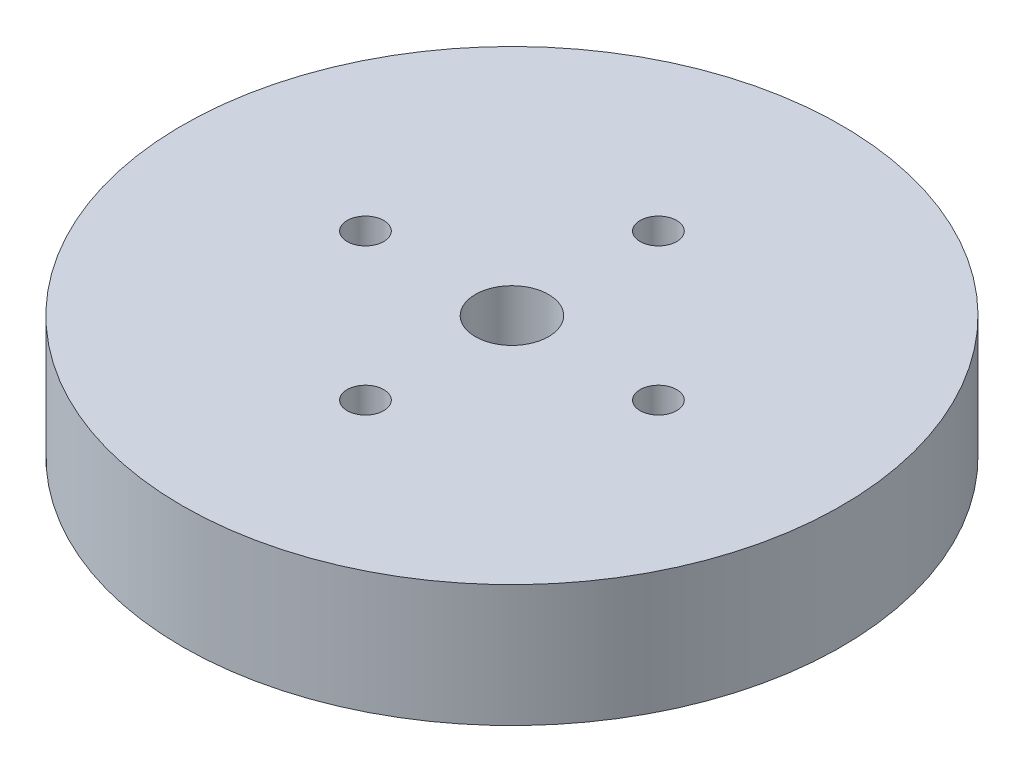
ISO-10303-21;
HEADER;
FILE_DESCRIPTION(('STEP AP214'),'2;1');
FILE_NAME('part.step','',(''),(''),'','','');
FILE_SCHEMA(('AUTOMOTIVE_DESIGN { 1 0 10303 214 1 1 1 1 }'));
ENDSEC;
DATA;
#1=APPLICATION_CONTEXT('core data for automotive mechanical design processes');
#2=APPLICATION_PROTOCOL_DEFINITION('international standard','automotive_design',2000,#1);
#3=PRODUCT_CONTEXT('',#1,'mechanical');
#4=PRODUCT('Part','Part','',(#3));
#5=PRODUCT_RELATED_PRODUCT_CATEGORY('part','',(#4));
#6=PRODUCT_DEFINITION_FORMATION('','',#4);
#7=PRODUCT_DEFINITION_CONTEXT('part definition',#1,'design');
#8=PRODUCT_DEFINITION('design','',#6,#7);
#9=PRODUCT_DEFINITION_SHAPE('','',#8);
#10=(LENGTH_UNIT() NAMED_UNIT(*) SI_UNIT(.MILLI.,.METRE.));
#11=(NAMED_UNIT(*) PLANE_ANGLE_UNIT() SI_UNIT($,.RADIAN.));
#12=(NAMED_UNIT(*) SI_UNIT($,.STERADIAN.) SOLID_ANGLE_UNIT());
#13=UNCERTAINTY_MEASURE_WITH_UNIT(LENGTH_MEASURE(1.E-05),#10,'distance_accuracy_value','');
#14=(GEOMETRIC_REPRESENTATION_CONTEXT(3) GLOBAL_UNCERTAINTY_ASSIGNED_CONTEXT((#13)) GLOBAL_UNIT_ASSIGNED_CONTEXT((#10,
#11,#12)) REPRESENTATION_CONTEXT('',''));
#15=CARTESIAN_POINT('',(0.,0.,0.));
#16=DIRECTION('',(0.,0.,1.));
#17=DIRECTION('',(1.,0.,0.));
#18=AXIS2_PLACEMENT_3D('',#15,#16,#17);
#19=CARTESIAN_POINT('',(0.,5.,0.));
#20=DIRECTION('',(0.,1.,0.));
#21=DIRECTION('',(0.,0.,1.));
#22=AXIS2_PLACEMENT_3D('',#19,#20,#21);
#23=PLANE('',#22);
#24=CARTESIAN_POINT('',(-6.,5.,0.));
#25=DIRECTION('',(0.,1.,0.));
#26=DIRECTION('',(0.,0.,1.));
#27=AXIS2_PLACEMENT_3D('',#24,#25,#26);
#28=CIRCLE('',#27,0.75);
#29=CARTESIAN_POINT('',(-6.,5.,0.749999999999958));
#30=VERTEX_POINT('',#29);
#31=EDGE_CURVE('E82',#30,#30,#28,.T.);
#32=ORIENTED_EDGE('',*,*,#31,.F.);
#33=EDGE_LOOP('',(#32));
#34=FACE_BOUND('',#33,.T.);
#35=CARTESIAN_POINT('',(0.,5.,-6.));
#36=DIRECTION('',(0.,1.,0.));
#37=DIRECTION('',(0.,0.,1.));
#38=AXIS2_PLACEMENT_3D('',#35,#36,#37);
#39=CIRCLE('',#38,0.75);
#40=CARTESIAN_POINT('',(0.,5.,-5.25));
#41=VERTEX_POINT('',#40);
#42=EDGE_CURVE('E111',#41,#41,#39,.T.);
#43=ORIENTED_EDGE('',*,*,#42,.F.);
#44=EDGE_LOOP('',(#43));
#45=FACE_BOUND('',#44,.T.);
#46=CARTESIAN_POINT('',(0.,5.,6.));
#47=DIRECTION('',(0.,1.,0.));
#48=DIRECTION('',(0.,0.,1.));
#49=AXIS2_PLACEMENT_3D('',#46,#47,#48);
#50=CIRCLE('',#49,0.749999999999999);
#51=CARTESIAN_POINT('',(0.,5.,6.75));
#52=VERTEX_POINT('',#51);
#53=EDGE_CURVE('E107',#52,#52,#50,.T.);
#54=ORIENTED_EDGE('',*,*,#53,.F.);
#55=EDGE_LOOP('',(#54));
#56=FACE_BOUND('',#55,.T.);
#57=CARTESIAN_POINT('',(6.,5.,0.));
#58=DIRECTION('',(0.,1.,0.));
#59=DIRECTION('',(0.,0.,1.));
#60=AXIS2_PLACEMENT_3D('',#57,#58,#59);
#61=CIRCLE('',#60,0.749999999999999);
#62=CARTESIAN_POINT('',(6.,5.,0.749999999999999));
#63=VERTEX_POINT('',#62);
#64=EDGE_CURVE('E103',#63,#63,#61,.T.);
#65=ORIENTED_EDGE('',*,*,#64,.F.);
#66=EDGE_LOOP('',(#65));
#67=FACE_BOUND('',#66,.T.);
#68=CARTESIAN_POINT('',(0.,5.,0.));
#69=DIRECTION('',(0.,1.,0.));
#70=DIRECTION('',(0.,0.,1.));
#71=AXIS2_PLACEMENT_3D('',#68,#69,#70);
#72=CIRCLE('',#71,13.5);
#73=CARTESIAN_POINT('',(0.,5.,13.5));
#74=VERTEX_POINT('',#73);
#75=EDGE_CURVE('E11',#74,#74,#72,.T.);
#76=ORIENTED_EDGE('',*,*,#75,.T.);
#77=EDGE_LOOP('',(#76));
#78=FACE_BOUND('',#77,.T.);
#79=CARTESIAN_POINT('',(0.,5.,0.));
#80=DIRECTION('',(0.,1.,0.));
#81=DIRECTION('',(0.,0.,1.));
#82=AXIS2_PLACEMENT_3D('',#79,#80,#81);
#83=CIRCLE('',#82,1.5);
#84=CARTESIAN_POINT('',(0.,5.,1.5));
#85=VERTEX_POINT('',#84);
#86=EDGE_CURVE('E71',#85,#85,#83,.T.);
#87=ORIENTED_EDGE('',*,*,#86,.F.);
#88=EDGE_LOOP('',(#87));
#89=FACE_BOUND('',#88,.T.);
#90=ADVANCED_FACE('F56',(#34,#45,#56,#67,#78,#89),#23,.T.);
#91=CARTESIAN_POINT('',(0.,0.,0.));
#92=DIRECTION('',(0.,1.,0.));
#93=DIRECTION('',(0.,0.,1.));
#94=AXIS2_PLACEMENT_3D('',#91,#92,#93);
#95=PLANE('',#94);
#96=CARTESIAN_POINT('',(-6.,0.,0.));
#97=DIRECTION('',(0.,1.,0.));
#98=DIRECTION('',(0.,0.,1.));
#99=AXIS2_PLACEMENT_3D('',#96,#97,#98);
#100=CIRCLE('',#99,0.75);
#101=CARTESIAN_POINT('',(-6.,0.,0.749999999999958));
#102=VERTEX_POINT('',#101);
#103=EDGE_CURVE('E60',#102,#102,#100,.T.);
#104=ORIENTED_EDGE('',*,*,#103,.T.);
#105=EDGE_LOOP('',(#104));
#106=FACE_BOUND('',#105,.T.);
#107=CARTESIAN_POINT('',(0.,0.,-6.));
#108=DIRECTION('',(0.,1.,0.));
#109=DIRECTION('',(0.,0.,1.));
#110=AXIS2_PLACEMENT_3D('',#107,#108,#109);
#111=CIRCLE('',#110,0.75);
#112=CARTESIAN_POINT('',(0.,0.,-5.25));
#113=VERTEX_POINT('',#112);
#114=EDGE_CURVE('E85',#113,#113,#111,.T.);
#115=ORIENTED_EDGE('',*,*,#114,.T.);
#116=EDGE_LOOP('',(#115));
#117=FACE_BOUND('',#116,.T.);
#118=CARTESIAN_POINT('',(0.,0.,6.));
#119=DIRECTION('',(0.,1.,0.));
#120=DIRECTION('',(0.,0.,1.));
#121=AXIS2_PLACEMENT_3D('',#118,#119,#120);
#122=CIRCLE('',#121,0.749999999999999);
#123=CARTESIAN_POINT('',(0.,0.,6.75));
#124=VERTEX_POINT('',#123);
#125=EDGE_CURVE('E81',#124,#124,#122,.T.);
#126=ORIENTED_EDGE('',*,*,#125,.T.);
#127=EDGE_LOOP('',(#126));
#128=FACE_BOUND('',#127,.T.);
#129=CARTESIAN_POINT('',(6.,0.,0.));
#130=DIRECTION('',(0.,1.,0.));
#131=DIRECTION('',(0.,0.,1.));
#132=AXIS2_PLACEMENT_3D('',#129,#130,#131);
#133=CIRCLE('',#132,0.749999999999999);
#134=CARTESIAN_POINT('',(6.,0.,0.749999999999999));
#135=VERTEX_POINT('',#134);
#136=EDGE_CURVE('E77',#135,#135,#133,.T.);
#137=ORIENTED_EDGE('',*,*,#136,.T.);
#138=EDGE_LOOP('',(#137));
#139=FACE_BOUND('',#138,.T.);
#140=CARTESIAN_POINT('',(0.,0.,0.));
#141=DIRECTION('',(0.,1.,0.));
#142=DIRECTION('',(0.,0.,1.));
#143=AXIS2_PLACEMENT_3D('',#140,#141,#142);
#144=CIRCLE('',#143,13.5);
#145=CARTESIAN_POINT('',(0.,0.,13.5));
#146=VERTEX_POINT('',#145);
#147=EDGE_CURVE('E65',#146,#146,#144,.T.);
#148=ORIENTED_EDGE('',*,*,#147,.F.);
#149=EDGE_LOOP('',(#148));
#150=FACE_BOUND('',#149,.T.);
#151=CARTESIAN_POINT('',(0.,0.,0.));
#152=DIRECTION('',(0.,1.,0.));
#153=DIRECTION('',(0.,0.,1.));
#154=AXIS2_PLACEMENT_3D('',#151,#152,#153);
#155=CIRCLE('',#154,1.5);
#156=CARTESIAN_POINT('',(0.,0.,1.5));
#157=VERTEX_POINT('',#156);
#158=EDGE_CURVE('E74',#157,#157,#155,.T.);
#159=ORIENTED_EDGE('',*,*,#158,.T.);
#160=EDGE_LOOP('',(#159));
#161=FACE_BOUND('',#160,.T.);
#162=ADVANCED_FACE('F124',(#106,#117,#128,#139,#150,#161),#95,.F.);
#163=CARTESIAN_POINT('',(0.,5.,0.));
#164=DIRECTION('',(0.,-1.,0.));
#165=DIRECTION('',(0.,0.,-1.));
#166=AXIS2_PLACEMENT_3D('',#163,#164,#165);
#167=CYLINDRICAL_SURFACE('',#166,13.5);
#168=ORIENTED_EDGE('',*,*,#75,.F.);
#169=EDGE_LOOP('',(#168));
#170=FACE_BOUND('',#169,.T.);
#171=ORIENTED_EDGE('',*,*,#147,.T.);
#172=EDGE_LOOP('',(#171));
#173=FACE_BOUND('',#172,.T.);
#174=ADVANCED_FACE('F58',(#170,#173),#167,.T.);
#175=CARTESIAN_POINT('',(0.,5.,0.));
#176=DIRECTION('',(0.,-1.,0.));
#177=DIRECTION('',(0.,0.,-1.));
#178=AXIS2_PLACEMENT_3D('',#175,#176,#177);
#179=CYLINDRICAL_SURFACE('',#178,1.5);
#180=ORIENTED_EDGE('',*,*,#86,.T.);
#181=EDGE_LOOP('',(#180));
#182=FACE_BOUND('',#181,.T.);
#183=ORIENTED_EDGE('',*,*,#158,.F.);
#184=EDGE_LOOP('',(#183));
#185=FACE_BOUND('',#184,.T.);
#186=ADVANCED_FACE('F137',(#182,#185),#179,.F.);
#187=CARTESIAN_POINT('',(6.,-29.,0.));
#188=DIRECTION('',(0.,1.,0.));
#189=DIRECTION('',(0.,0.,1.));
#190=AXIS2_PLACEMENT_3D('',#187,#188,#189);
#191=CYLINDRICAL_SURFACE('',#190,0.749999999999999);
#192=ORIENTED_EDGE('',*,*,#64,.T.);
#193=EDGE_LOOP('',(#192));
#194=FACE_BOUND('',#193,.T.);
#195=ORIENTED_EDGE('',*,*,#136,.F.);
#196=EDGE_LOOP('',(#195));
#197=FACE_BOUND('',#196,.T.);
#198=ADVANCED_FACE('F133',(#194,#197),#191,.F.);
#199=CARTESIAN_POINT('',(0.,-29.,6.));
#200=DIRECTION('',(0.,1.,0.));
#201=DIRECTION('',(0.,0.,1.));
#202=AXIS2_PLACEMENT_3D('',#199,#200,#201);
#203=CYLINDRICAL_SURFACE('',#202,0.749999999999999);
#204=ORIENTED_EDGE('',*,*,#53,.T.);
#205=EDGE_LOOP('',(#204));
#206=FACE_BOUND('',#205,.T.);
#207=ORIENTED_EDGE('',*,*,#125,.F.);
#208=EDGE_LOOP('',(#207));
#209=FACE_BOUND('',#208,.T.);
#210=ADVANCED_FACE('F136',(#206,#209),#203,.F.);
#211=CARTESIAN_POINT('',(0.,-29.,-6.));
#212=DIRECTION('',(0.,1.,0.));
#213=DIRECTION('',(0.,0.,1.));
#214=AXIS2_PLACEMENT_3D('',#211,#212,#213);
#215=CYLINDRICAL_SURFACE('',#214,0.75);
#216=ORIENTED_EDGE('',*,*,#42,.T.);
#217=EDGE_LOOP('',(#216));
#218=FACE_BOUND('',#217,.T.);
#219=ORIENTED_EDGE('',*,*,#114,.F.);
#220=EDGE_LOOP('',(#219));
#221=FACE_BOUND('',#220,.T.);
#222=ADVANCED_FACE('F157',(#218,#221),#215,.F.);
#223=CARTESIAN_POINT('',(-6.,-29.,0.));
#224=DIRECTION('',(0.,1.,0.));
#225=DIRECTION('',(0.,0.,1.));
#226=AXIS2_PLACEMENT_3D('',#223,#224,#225);
#227=CYLINDRICAL_SURFACE('',#226,0.75);
#228=ORIENTED_EDGE('',*,*,#31,.T.);
#229=EDGE_LOOP('',(#228));
#230=FACE_BOUND('',#229,.T.);
#231=ORIENTED_EDGE('',*,*,#103,.F.);
#232=EDGE_LOOP('',(#231));
#233=FACE_BOUND('',#232,.T.);
#234=ADVANCED_FACE('F119',(#230,#233),#227,.F.);
#235=CLOSED_SHELL('',(#90,#162,#174,#186,#198,#210,#222,#234));
#236=MANIFOLD_SOLID_BREP('B2',#235);
#237=ADVANCED_BREP_SHAPE_REPRESENTATION('',(#18,#236),#14);
#238=SHAPE_DEFINITION_REPRESENTATION(#9,#237);
ENDSEC;
END-ISO-10303-21;
